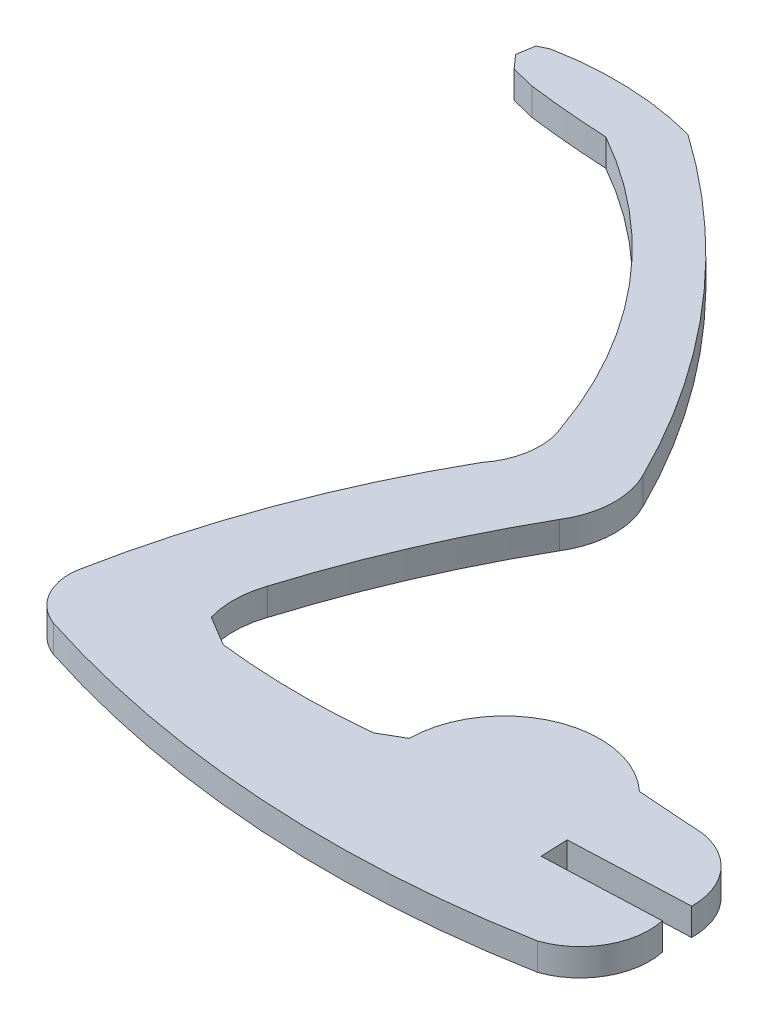
ISO-10303-21;
HEADER;
FILE_DESCRIPTION(('STEP AP214'),'2;1');
FILE_NAME('part.step','',(''),(''),'','','');
FILE_SCHEMA(('AUTOMOTIVE_DESIGN { 1 0 10303 214 1 1 1 1 }'));
ENDSEC;
DATA;
#1=APPLICATION_CONTEXT('core data for automotive mechanical design processes');
#2=APPLICATION_PROTOCOL_DEFINITION('international standard','automotive_design',2000,#1);
#3=PRODUCT_CONTEXT('',#1,'mechanical');
#4=PRODUCT('Part','Part','',(#3));
#5=PRODUCT_RELATED_PRODUCT_CATEGORY('part','',(#4));
#6=PRODUCT_DEFINITION_FORMATION('','',#4);
#7=PRODUCT_DEFINITION_CONTEXT('part definition',#1,'design');
#8=PRODUCT_DEFINITION('design','',#6,#7);
#9=PRODUCT_DEFINITION_SHAPE('','',#8);
#10=(LENGTH_UNIT() NAMED_UNIT(*) SI_UNIT(.MILLI.,.METRE.));
#11=(NAMED_UNIT(*) PLANE_ANGLE_UNIT() SI_UNIT($,.RADIAN.));
#12=(NAMED_UNIT(*) SI_UNIT($,.STERADIAN.) SOLID_ANGLE_UNIT());
#13=UNCERTAINTY_MEASURE_WITH_UNIT(LENGTH_MEASURE(1.E-05),#10,'distance_accuracy_value','');
#14=(GEOMETRIC_REPRESENTATION_CONTEXT(3) GLOBAL_UNCERTAINTY_ASSIGNED_CONTEXT((#13)) GLOBAL_UNIT_ASSIGNED_CONTEXT((#10,
#11,#12)) REPRESENTATION_CONTEXT('',''));
#15=CARTESIAN_POINT('',(0.,0.,0.));
#16=DIRECTION('',(0.,0.,1.));
#17=DIRECTION('',(1.,0.,0.));
#18=AXIS2_PLACEMENT_3D('',#15,#16,#17);
#19=CARTESIAN_POINT('',(-274.22126506996,2.,-439.815808865436));
#20=DIRECTION('',(0.,-1.,0.));
#21=DIRECTION('',(0.,0.,-1.));
#22=AXIS2_PLACEMENT_3D('',#19,#20,#21);
#23=CYLINDRICAL_SURFACE('',#22,3.92701941509999);
#24=CARTESIAN_POINT('',(-274.22126506996,0.,-439.815808865436));
#25=DIRECTION('',(0.,1.,0.));
#26=DIRECTION('',(0.,0.,1.));
#27=AXIS2_PLACEMENT_3D('',#24,#25,#26);
#28=CIRCLE('',#27,3.92701941509999);
#29=CARTESIAN_POINT('',(-278.096570000035,0.,-440.451020000024));
#30=VERTEX_POINT('',#29);
#31=CARTESIAN_POINT('',(-275.639010000101,0.,-436.15363999991));
#32=VERTEX_POINT('',#31);
#33=EDGE_CURVE('E11',#30,#32,#28,.T.);
#34=ORIENTED_EDGE('',*,*,#33,.T.);
#35=DIRECTION('',(0.,-1.,0.));
#36=VECTOR('',#35,1.);
#37=CARTESIAN_POINT('',(-275.639010000101,2.,-436.15363999991));
#38=LINE('',#37,#36);
#39=CARTESIAN_POINT('',(-275.639010000101,2.,-436.15363999991));
#40=VERTEX_POINT('',#39);
#41=EDGE_CURVE('E487',#40,#32,#38,.T.);
#42=ORIENTED_EDGE('',*,*,#41,.F.);
#43=CARTESIAN_POINT('',(-274.22126506996,2.,-439.815808865436));
#44=DIRECTION('',(0.,1.,0.));
#45=DIRECTION('',(0.,0.,1.));
#46=AXIS2_PLACEMENT_3D('',#43,#44,#45);
#47=CIRCLE('',#46,3.92701941509999);
#48=CARTESIAN_POINT('',(-278.096570000035,2.,-440.451020000024));
#49=VERTEX_POINT('',#48);
#50=EDGE_CURVE('E41',#49,#40,#47,.T.);
#51=ORIENTED_EDGE('',*,*,#50,.F.);
#52=DIRECTION('',(0.,-1.,0.));
#53=VECTOR('',#52,1.);
#54=CARTESIAN_POINT('',(-278.096570000035,2.,-440.451020000024));
#55=LINE('',#54,#53);
#56=EDGE_CURVE('E242',#49,#30,#55,.T.);
#57=ORIENTED_EDGE('',*,*,#56,.T.);
#58=EDGE_LOOP('',(#34,#42,#51,#57));
#59=FACE_BOUND('',#58,.T.);
#60=ADVANCED_FACE('F37',(#59),#23,.T.);
#61=CARTESIAN_POINT('',(-251.733783557694,2.,-510.33694022932));
#62=DIRECTION('',(0.,-1.,0.));
#63=DIRECTION('',(0.,0.,-1.));
#64=AXIS2_PLACEMENT_3D('',#61,#62,#63);
#65=CYLINDRICAL_SURFACE('',#64,77.9398606888);
#66=CARTESIAN_POINT('',(-251.733783557694,0.,-510.33694022932));
#67=DIRECTION('',(0.,1.,0.));
#68=DIRECTION('',(0.,0.,1.));
#69=AXIS2_PLACEMENT_3D('',#66,#67,#68);
#70=CIRCLE('',#69,77.9398606888);
#71=CARTESIAN_POINT('',(-237.552510000029,0.,-433.698089999999));
#72=VERTEX_POINT('',#71);
#73=EDGE_CURVE('E47',#32,#72,#70,.T.);
#74=ORIENTED_EDGE('',*,*,#73,.T.);
#75=DIRECTION('',(0.,-1.,0.));
#76=VECTOR('',#75,1.);
#77=CARTESIAN_POINT('',(-237.552510000029,2.,-433.698089999999));
#78=LINE('',#77,#76);
#79=CARTESIAN_POINT('',(-237.552510000029,2.,-433.698089999999));
#80=VERTEX_POINT('',#79);
#81=EDGE_CURVE('E218',#80,#72,#78,.T.);
#82=ORIENTED_EDGE('',*,*,#81,.F.);
#83=CARTESIAN_POINT('',(-251.733783557694,2.,-510.33694022932));
#84=DIRECTION('',(0.,1.,0.));
#85=DIRECTION('',(0.,0.,1.));
#86=AXIS2_PLACEMENT_3D('',#83,#84,#85);
#87=CIRCLE('',#86,77.9398606888);
#88=EDGE_CURVE('E134',#40,#80,#87,.T.);
#89=ORIENTED_EDGE('',*,*,#88,.F.);
#90=ORIENTED_EDGE('',*,*,#41,.T.);
#91=EDGE_LOOP('',(#74,#82,#89,#90));
#92=FACE_BOUND('',#91,.T.);
#93=ADVANCED_FACE('F488',(#92),#65,.T.);
#94=CARTESIAN_POINT('',(-239.234869053948,2.,-438.506591685708));
#95=DIRECTION('',(0.,-1.,0.));
#96=DIRECTION('',(0.,0.,-1.));
#97=AXIS2_PLACEMENT_3D('',#94,#95,#96);
#98=CYLINDRICAL_SURFACE('',#97,5.0943125589001);
#99=CARTESIAN_POINT('',(-239.234869053948,0.,-438.506591685708));
#100=DIRECTION('',(0.,1.,0.));
#101=DIRECTION('',(0.,0.,1.));
#102=AXIS2_PLACEMENT_3D('',#99,#100,#101);
#103=CIRCLE('',#102,5.0943125589001);
#104=CARTESIAN_POINT('',(-234.253990000039,0.,-439.575639999907));
#105=VERTEX_POINT('',#104);
#106=EDGE_CURVE('E212',#72,#105,#103,.T.);
#107=ORIENTED_EDGE('',*,*,#106,.T.);
#108=DIRECTION('',(0.,-1.,0.));
#109=VECTOR('',#108,1.);
#110=CARTESIAN_POINT('',(-234.253990000039,2.,-439.575639999907));
#111=LINE('',#110,#109);
#112=CARTESIAN_POINT('',(-234.253990000039,2.,-439.575639999907));
#113=VERTEX_POINT('',#112);
#114=EDGE_CURVE('E216',#113,#105,#111,.T.);
#115=ORIENTED_EDGE('',*,*,#114,.F.);
#116=CARTESIAN_POINT('',(-239.234869053948,2.,-438.506591685708));
#117=DIRECTION('',(0.,1.,0.));
#118=DIRECTION('',(0.,0.,1.));
#119=AXIS2_PLACEMENT_3D('',#116,#117,#118);
#120=CIRCLE('',#119,5.0943125589001);
#121=EDGE_CURVE('E289',#80,#113,#120,.T.);
#122=ORIENTED_EDGE('',*,*,#121,.F.);
#123=ORIENTED_EDGE('',*,*,#81,.T.);
#124=EDGE_LOOP('',(#107,#115,#122,#123));
#125=FACE_BOUND('',#124,.T.);
#126=ADVANCED_FACE('F214',(#125),#98,.T.);
#127=CARTESIAN_POINT('',(-234.253990000039,2.,-439.575639999907));
#128=DIRECTION('',(0.040186059139724,0.,0.999192214066352));
#129=DIRECTION('',(0.999192214066352,0.,-0.040186059139724));
#130=AXIS2_PLACEMENT_3D('',#127,#128,#129);
#131=PLANE('',#130);
#132=DIRECTION('',(-0.999192214066352,0.,0.040186059139724));
#133=VECTOR('',#132,1.);
#134=CARTESIAN_POINT('',(-234.253990000039,0.,-439.575639999907));
#135=LINE('',#134,#133);
#136=CARTESIAN_POINT('',(-242.830630000012,0.,-439.230699999968));
#137=VERTEX_POINT('',#136);
#138=EDGE_CURVE('E220',#105,#137,#135,.T.);
#139=ORIENTED_EDGE('',*,*,#138,.T.);
#140=DIRECTION('',(0.,-1.,0.));
#141=VECTOR('',#140,1.);
#142=CARTESIAN_POINT('',(-242.830630000012,2.,-439.230699999968));
#143=LINE('',#142,#141);
#144=CARTESIAN_POINT('',(-242.830630000012,2.,-439.230699999968));
#145=VERTEX_POINT('',#144);
#146=EDGE_CURVE('E227',#145,#137,#143,.T.);
#147=ORIENTED_EDGE('',*,*,#146,.F.);
#148=DIRECTION('',(-0.999192214066352,0.,0.040186059139724));
#149=VECTOR('',#148,1.);
#150=CARTESIAN_POINT('',(-234.253990000039,2.,-439.575639999907));
#151=LINE('',#150,#149);
#152=EDGE_CURVE('E226',#113,#145,#151,.T.);
#153=ORIENTED_EDGE('',*,*,#152,.F.);
#154=ORIENTED_EDGE('',*,*,#114,.T.);
#155=EDGE_LOOP('',(#139,#147,#153,#154));
#156=FACE_BOUND('',#155,.T.);
#157=ADVANCED_FACE('F223',(#156),#131,.F.);
#158=CARTESIAN_POINT('',(-242.830630000012,2.,-439.230699999968));
#159=DIRECTION('',(-0.999192261092867,0.,0.040184889848341));
#160=DIRECTION('',(0.040184889848341,0.,0.999192261092867));
#161=AXIS2_PLACEMENT_3D('',#158,#159,#160);
#162=PLANE('',#161);
#163=DIRECTION('',(-0.040184889848341,0.,-0.999192261092867));
#164=VECTOR('',#163,1.);
#165=CARTESIAN_POINT('',(-242.830630000012,0.,-439.230699999968));
#166=LINE('',#165,#164);
#167=CARTESIAN_POINT('',(-242.911000000009,0.,-441.229089999896));
#168=VERTEX_POINT('',#167);
#169=EDGE_CURVE('E232',#137,#168,#166,.T.);
#170=ORIENTED_EDGE('',*,*,#169,.T.);
#171=DIRECTION('',(0.,-1.,0.));
#172=VECTOR('',#171,1.);
#173=CARTESIAN_POINT('',(-242.911000000009,2.,-441.229089999896));
#174=LINE('',#173,#172);
#175=CARTESIAN_POINT('',(-242.911000000009,2.,-441.229089999896));
#176=VERTEX_POINT('',#175);
#177=EDGE_CURVE('E350',#176,#168,#174,.T.);
#178=ORIENTED_EDGE('',*,*,#177,.F.);
#179=DIRECTION('',(-0.040184889848341,0.,-0.999192261092867));
#180=VECTOR('',#179,1.);
#181=CARTESIAN_POINT('',(-242.830630000012,2.,-439.230699999968));
#182=LINE('',#181,#180);
#183=EDGE_CURVE('E286',#145,#176,#182,.T.);
#184=ORIENTED_EDGE('',*,*,#183,.F.);
#185=ORIENTED_EDGE('',*,*,#146,.T.);
#186=EDGE_LOOP('',(#170,#178,#184,#185));
#187=FACE_BOUND('',#186,.T.);
#188=ADVANCED_FACE('F483',(#187),#162,.F.);
#189=CARTESIAN_POINT('',(-242.911000000009,2.,-441.229089999896));
#190=DIRECTION('',(-0.0401857549887955,0.,-0.999192226298814));
#191=DIRECTION('',(-0.999192226298814,0.,0.0401857549887955));
#192=AXIS2_PLACEMENT_3D('',#189,#190,#191);
#193=PLANE('',#192);
#194=DIRECTION('',(0.999192226298814,0.,-0.0401857549887955));
#195=VECTOR('',#194,1.);
#196=CARTESIAN_POINT('',(-242.911000000009,0.,-441.229089999896));
#197=LINE('',#196,#195);
#198=CARTESIAN_POINT('',(-234.109769999948,0.,-441.583059999935));
#199=VERTEX_POINT('',#198);
#200=EDGE_CURVE('E234',#168,#199,#197,.T.);
#201=ORIENTED_EDGE('',*,*,#200,.T.);
#202=DIRECTION('',(0.,-1.,0.));
#203=VECTOR('',#202,1.);
#204=CARTESIAN_POINT('',(-234.109769999948,2.,-441.583059999935));
#205=LINE('',#204,#203);
#206=CARTESIAN_POINT('',(-234.109769999948,2.,-441.583059999935));
#207=VERTEX_POINT('',#206);
#208=EDGE_CURVE('E347',#207,#199,#205,.T.);
#209=ORIENTED_EDGE('',*,*,#208,.F.);
#210=DIRECTION('',(0.999192226298814,0.,-0.0401857549887955));
#211=VECTOR('',#210,1.);
#212=CARTESIAN_POINT('',(-242.911000000009,2.,-441.229089999896));
#213=LINE('',#212,#211);
#214=EDGE_CURVE('E284',#176,#207,#213,.T.);
#215=ORIENTED_EDGE('',*,*,#214,.F.);
#216=ORIENTED_EDGE('',*,*,#177,.T.);
#217=EDGE_LOOP('',(#201,#209,#215,#216));
#218=FACE_BOUND('',#217,.T.);
#219=ADVANCED_FACE('F345',(#218),#193,.F.);
#220=CARTESIAN_POINT('',(-239.110909892009,2.,-441.682689871096));
#221=DIRECTION('',(0.,-1.,0.));
#222=DIRECTION('',(0.,0.,-1.));
#223=AXIS2_PLACEMENT_3D('',#220,#221,#222);
#224=CYLINDRICAL_SURFACE('',#223,5.00213217850003);
#225=CARTESIAN_POINT('',(-239.110909892009,0.,-441.682689871096));
#226=DIRECTION('',(0.,1.,0.));
#227=DIRECTION('',(0.,0.,1.));
#228=AXIS2_PLACEMENT_3D('',#225,#226,#227);
#229=CIRCLE('',#228,5.00213217850003);
#230=CARTESIAN_POINT('',(-238.334759999981,0.,-446.624239999981));
#231=VERTEX_POINT('',#230);
#232=EDGE_CURVE('E339',#199,#231,#229,.T.);
#233=ORIENTED_EDGE('',*,*,#232,.T.);
#234=DIRECTION('',(0.,-1.,0.));
#235=VECTOR('',#234,1.);
#236=CARTESIAN_POINT('',(-238.334759999981,2.,-446.624239999981));
#237=LINE('',#236,#235);
#238=CARTESIAN_POINT('',(-238.334759999981,2.,-446.624239999981));
#239=VERTEX_POINT('',#238);
#240=EDGE_CURVE('E355',#239,#231,#237,.T.);
#241=ORIENTED_EDGE('',*,*,#240,.F.);
#242=CARTESIAN_POINT('',(-239.110909892009,2.,-441.682689871096));
#243=DIRECTION('',(0.,1.,0.));
#244=DIRECTION('',(0.,0.,1.));
#245=AXIS2_PLACEMENT_3D('',#242,#243,#244);
#246=CIRCLE('',#245,5.00213217850003);
#247=EDGE_CURVE('E282',#207,#239,#246,.T.);
#248=ORIENTED_EDGE('',*,*,#247,.F.);
#249=ORIENTED_EDGE('',*,*,#208,.T.);
#250=EDGE_LOOP('',(#233,#241,#248,#249));
#251=FACE_BOUND('',#250,.T.);
#252=ADVANCED_FACE('F353',(#251),#224,.T.);
#253=CARTESIAN_POINT('',(-217.013235186205,2.,-786.303353346965));
#254=DIRECTION('',(0.,-1.,0.));
#255=DIRECTION('',(0.,0.,-1.));
#256=AXIS2_PLACEMENT_3D('',#253,#254,#255);
#257=CYLINDRICAL_SURFACE('',#256,340.347627382031);
#258=CARTESIAN_POINT('',(-217.013235186205,0.,-786.303353346965));
#259=DIRECTION('',(0.,1.,0.));
#260=DIRECTION('',(0.,0.,1.));
#261=AXIS2_PLACEMENT_3D('',#258,#259,#260);
#262=CIRCLE('',#261,340.347627382031);
#263=CARTESIAN_POINT('',(-243.33684000018,0.,-446.975229999997));
#264=VERTEX_POINT('',#263);
#265=EDGE_CURVE('E336',#264,#231,#262,.T.);
#266=ORIENTED_EDGE('',*,*,#265,.F.);
#267=DIRECTION('',(0.,-1.,0.));
#268=VECTOR('',#267,1.);
#269=CARTESIAN_POINT('',(-243.33684000018,2.,-446.975229999997));
#270=LINE('',#269,#268);
#271=CARTESIAN_POINT('',(-243.33684000018,2.,-446.975229999997));
#272=VERTEX_POINT('',#271);
#273=EDGE_CURVE('E362',#272,#264,#270,.T.);
#274=ORIENTED_EDGE('',*,*,#273,.F.);
#275=CARTESIAN_POINT('',(-217.013235186205,2.,-786.303353346965));
#276=DIRECTION('',(0.,1.,0.));
#277=DIRECTION('',(0.,0.,1.));
#278=AXIS2_PLACEMENT_3D('',#275,#276,#277);
#279=CIRCLE('',#278,340.347627382031);
#280=EDGE_CURVE('E279',#272,#239,#279,.T.);
#281=ORIENTED_EDGE('',*,*,#280,.T.);
#282=ORIENTED_EDGE('',*,*,#240,.T.);
#283=EDGE_LOOP('',(#266,#274,#281,#282));
#284=FACE_BOUND('',#283,.T.);
#285=ADVANCED_FACE('F361',(#284),#257,.F.);
#286=CARTESIAN_POINT('',(-248.1458302378,2.,-441.83572989779));
#287=DIRECTION('',(0.,-1.,0.));
#288=DIRECTION('',(0.,0.,-1.));
#289=AXIS2_PLACEMENT_3D('',#286,#287,#288);
#290=CYLINDRICAL_SURFACE('',#289,7.03852601089998);
#291=CARTESIAN_POINT('',(-248.1458302378,0.,-441.83572989779));
#292=DIRECTION('',(0.,1.,0.));
#293=DIRECTION('',(0.,0.,1.));
#294=AXIS2_PLACEMENT_3D('',#291,#292,#293);
#295=CIRCLE('',#294,7.03852601089998);
#296=CARTESIAN_POINT('',(-255.184160000021,0.,-441.888290000021));
#297=VERTEX_POINT('',#296);
#298=EDGE_CURVE('E334',#264,#297,#295,.T.);
#299=ORIENTED_EDGE('',*,*,#298,.T.);
#300=DIRECTION('',(0.,-1.,0.));
#301=VECTOR('',#300,1.);
#302=CARTESIAN_POINT('',(-255.184160000021,2.,-441.888290000021));
#303=LINE('',#302,#301);
#304=CARTESIAN_POINT('',(-255.184160000021,2.,-441.888290000021));
#305=VERTEX_POINT('',#304);
#306=EDGE_CURVE('E366',#305,#297,#303,.T.);
#307=ORIENTED_EDGE('',*,*,#306,.F.);
#308=CARTESIAN_POINT('',(-248.1458302378,2.,-441.83572989779));
#309=DIRECTION('',(0.,1.,0.));
#310=DIRECTION('',(0.,0.,1.));
#311=AXIS2_PLACEMENT_3D('',#308,#309,#310);
#312=CIRCLE('',#311,7.03852601089998);
#313=EDGE_CURVE('E277',#272,#305,#312,.T.);
#314=ORIENTED_EDGE('',*,*,#313,.F.);
#315=ORIENTED_EDGE('',*,*,#273,.T.);
#316=EDGE_LOOP('',(#299,#307,#314,#315));
#317=FACE_BOUND('',#316,.T.);
#318=ADVANCED_FACE('F480',(#317),#290,.T.);
#319=CARTESIAN_POINT('',(-255.184160000021,2.,-441.888290000021));
#320=DIRECTION('',(0.500754897130129,0.,0.865589124816269));
#321=DIRECTION('',(0.865589124816269,0.,-0.500754897130129));
#322=AXIS2_PLACEMENT_3D('',#319,#320,#321);
#323=PLANE('',#322);
#324=DIRECTION('',(-0.865589124816269,0.,0.500754897130129));
#325=VECTOR('',#324,1.);
#326=CARTESIAN_POINT('',(-255.184160000021,0.,-441.888290000021));
#327=LINE('',#326,#325);
#328=CARTESIAN_POINT('',(-256.851709999999,0.,-440.923590000034));
#329=VERTEX_POINT('',#328);
#330=EDGE_CURVE('E331',#297,#329,#327,.T.);
#331=ORIENTED_EDGE('',*,*,#330,.T.);
#332=DIRECTION('',(0.,-1.,0.));
#333=VECTOR('',#332,1.);
#334=CARTESIAN_POINT('',(-256.851709999999,2.,-440.923590000034));
#335=LINE('',#334,#333);
#336=CARTESIAN_POINT('',(-256.851709999999,2.,-440.923590000034));
#337=VERTEX_POINT('',#336);
#338=EDGE_CURVE('E372',#337,#329,#335,.T.);
#339=ORIENTED_EDGE('',*,*,#338,.F.);
#340=DIRECTION('',(-0.865589124816269,0.,0.500754897130129));
#341=VECTOR('',#340,1.);
#342=CARTESIAN_POINT('',(-255.184160000021,2.,-441.888290000021));
#343=LINE('',#342,#341);
#344=EDGE_CURVE('E275',#305,#337,#343,.T.);
#345=ORIENTED_EDGE('',*,*,#344,.F.);
#346=ORIENTED_EDGE('',*,*,#306,.T.);
#347=EDGE_LOOP('',(#331,#339,#345,#346));
#348=FACE_BOUND('',#347,.T.);
#349=ADVANCED_FACE('F476',(#348),#323,.F.);
#350=CARTESIAN_POINT('',(-262.025023213898,2.,-491.59750002542));
#351=DIRECTION('',(0.,-1.,0.));
#352=DIRECTION('',(0.,0.,-1.));
#353=AXIS2_PLACEMENT_3D('',#350,#351,#352);
#354=CYLINDRICAL_SURFACE('',#353,50.9372979934174);
#355=CARTESIAN_POINT('',(-262.025023213898,0.,-491.59750002542));
#356=DIRECTION('',(0.,1.,0.));
#357=DIRECTION('',(0.,0.,1.));
#358=AXIS2_PLACEMENT_3D('',#355,#356,#357);
#359=CIRCLE('',#358,50.9372979934174);
#360=CARTESIAN_POINT('',(-267.997119999992,0.,-441.011510000041));
#361=VERTEX_POINT('',#360);
#362=EDGE_CURVE('E328',#361,#329,#359,.T.);
#363=ORIENTED_EDGE('',*,*,#362,.F.);
#364=DIRECTION('',(0.,-1.,0.));
#365=VECTOR('',#364,1.);
#366=CARTESIAN_POINT('',(-267.997119999992,2.,-441.011510000041));
#367=LINE('',#366,#365);
#368=CARTESIAN_POINT('',(-267.997119999992,2.,-441.011510000041));
#369=VERTEX_POINT('',#368);
#370=EDGE_CURVE('E374',#369,#361,#367,.T.);
#371=ORIENTED_EDGE('',*,*,#370,.F.);
#372=CARTESIAN_POINT('',(-262.025023213898,2.,-491.59750002542));
#373=DIRECTION('',(0.,1.,0.));
#374=DIRECTION('',(0.,0.,1.));
#375=AXIS2_PLACEMENT_3D('',#372,#373,#374);
#376=CIRCLE('',#375,50.9372979934174);
#377=EDGE_CURVE('E272',#369,#337,#376,.T.);
#378=ORIENTED_EDGE('',*,*,#377,.T.);
#379=ORIENTED_EDGE('',*,*,#338,.T.);
#380=EDGE_LOOP('',(#363,#371,#378,#379));
#381=FACE_BOUND('',#380,.T.);
#382=ADVANCED_FACE('F473',(#381),#354,.F.);
#383=CARTESIAN_POINT('',(-267.997119999993,2.,-441.011510000038));
#384=DIRECTION('',(-0.514221496956717,0.,0.857657421158118));
#385=DIRECTION('',(0.857657421158118,0.,0.514221496956717));
#386=AXIS2_PLACEMENT_3D('',#383,#384,#385);
#387=PLANE('',#386);
#388=DIRECTION('',(-0.857657421158118,0.,-0.514221496956717));
#389=VECTOR('',#388,1.);
#390=CARTESIAN_POINT('',(-267.997119999993,0.,-441.011510000038));
#391=LINE('',#390,#389);
#392=CARTESIAN_POINT('',(-270.19096,0.,-442.32686));
#393=VERTEX_POINT('',#392);
#394=EDGE_CURVE('E325',#361,#393,#391,.T.);
#395=ORIENTED_EDGE('',*,*,#394,.T.);
#396=DIRECTION('',(0.,-1.,0.));
#397=VECTOR('',#396,1.);
#398=CARTESIAN_POINT('',(-270.19096,2.,-442.32686));
#399=LINE('',#398,#397);
#400=CARTESIAN_POINT('',(-270.19096,2.,-442.32686));
#401=VERTEX_POINT('',#400);
#402=EDGE_CURVE('E376',#401,#393,#399,.T.);
#403=ORIENTED_EDGE('',*,*,#402,.F.);
#404=DIRECTION('',(-0.857657421158118,0.,-0.514221496956717));
#405=VECTOR('',#404,1.);
#406=CARTESIAN_POINT('',(-267.997119999993,2.,-441.011510000038));
#407=LINE('',#406,#405);
#408=EDGE_CURVE('E270',#369,#401,#407,.T.);
#409=ORIENTED_EDGE('',*,*,#408,.F.);
#410=ORIENTED_EDGE('',*,*,#370,.T.);
#411=EDGE_LOOP('',(#395,#403,#409,#410));
#412=FACE_BOUND('',#411,.T.);
#413=ADVANCED_FACE('F470',(#412),#387,.F.);
#414=CARTESIAN_POINT('',(-263.721229898124,2.,-444.204594696384));
#415=DIRECTION('',(0.,-1.,0.));
#416=DIRECTION('',(0.,0.,-1.));
#417=AXIS2_PLACEMENT_3D('',#414,#415,#416);
#418=CYLINDRICAL_SURFACE('',#417,6.73671249060423);
#419=CARTESIAN_POINT('',(-263.721229898124,0.,-444.204594696384));
#420=DIRECTION('',(0.,1.,0.));
#421=DIRECTION('',(0.,0.,1.));
#422=AXIS2_PLACEMENT_3D('',#419,#420,#421);
#423=CIRCLE('',#422,6.73671249060423);
#424=CARTESIAN_POINT('',(-270.103430000059,0.,-446.361169999945));
#425=VERTEX_POINT('',#424);
#426=EDGE_CURVE('E322',#425,#393,#423,.T.);
#427=ORIENTED_EDGE('',*,*,#426,.F.);
#428=DIRECTION('',(0.,-1.,0.));
#429=VECTOR('',#428,1.);
#430=CARTESIAN_POINT('',(-270.103430000059,2.,-446.361169999945));
#431=LINE('',#430,#429);
#432=CARTESIAN_POINT('',(-270.103430000059,2.,-446.361169999945));
#433=VERTEX_POINT('',#432);
#434=EDGE_CURVE('E378',#433,#425,#431,.T.);
#435=ORIENTED_EDGE('',*,*,#434,.F.);
#436=CARTESIAN_POINT('',(-263.721229898124,2.,-444.204594696384));
#437=DIRECTION('',(0.,1.,0.));
#438=DIRECTION('',(0.,0.,1.));
#439=AXIS2_PLACEMENT_3D('',#436,#437,#438);
#440=CIRCLE('',#439,6.73671249060423);
#441=EDGE_CURVE('E267',#433,#401,#440,.T.);
#442=ORIENTED_EDGE('',*,*,#441,.T.);
#443=ORIENTED_EDGE('',*,*,#402,.T.);
#444=EDGE_LOOP('',(#427,#435,#442,#443));
#445=FACE_BOUND('',#444,.T.);
#446=ADVANCED_FACE('F465',(#445),#418,.F.);
#447=CARTESIAN_POINT('',(-198.8151189418,2.,-424.3956924438));
#448=DIRECTION('',(0.,-1.,0.));
#449=DIRECTION('',(0.,0.,-1.));
#450=AXIS2_PLACEMENT_3D('',#447,#448,#449);
#451=CYLINDRICAL_SURFACE('',#450,74.5956131271);
#452=CARTESIAN_POINT('',(-198.8151189418,0.,-424.3956924438));
#453=DIRECTION('',(0.,1.,0.));
#454=DIRECTION('',(0.,0.,1.));
#455=AXIS2_PLACEMENT_3D('',#452,#453,#454);
#456=CIRCLE('',#455,74.5956131271);
#457=CARTESIAN_POINT('',(-263.609420000075,0.,-461.35788999992));
#458=VERTEX_POINT('',#457);
#459=EDGE_CURVE('E319',#458,#425,#456,.T.);
#460=ORIENTED_EDGE('',*,*,#459,.F.);
#461=DIRECTION('',(0.,-1.,0.));
#462=VECTOR('',#461,1.);
#463=CARTESIAN_POINT('',(-263.609420000075,2.,-461.35788999992));
#464=LINE('',#463,#462);
#465=CARTESIAN_POINT('',(-263.609420000075,2.,-461.35788999992));
#466=VERTEX_POINT('',#465);
#467=EDGE_CURVE('E380',#466,#458,#464,.T.);
#468=ORIENTED_EDGE('',*,*,#467,.F.);
#469=CARTESIAN_POINT('',(-198.8151189418,2.,-424.3956924438));
#470=DIRECTION('',(0.,1.,0.));
#471=DIRECTION('',(0.,0.,1.));
#472=AXIS2_PLACEMENT_3D('',#469,#470,#471);
#473=CIRCLE('',#472,74.5956131271);
#474=EDGE_CURVE('E264',#466,#433,#473,.T.);
#475=ORIENTED_EDGE('',*,*,#474,.T.);
#476=ORIENTED_EDGE('',*,*,#434,.T.);
#477=EDGE_LOOP('',(#460,#468,#475,#476));
#478=FACE_BOUND('',#477,.T.);
#479=ADVANCED_FACE('F460',(#478),#451,.F.);
#480=CARTESIAN_POINT('',(-268.700979891225,2.,-464.53037242465));
#481=DIRECTION('',(0.,-1.,0.));
#482=DIRECTION('',(0.,0.,-1.));
#483=AXIS2_PLACEMENT_3D('',#480,#481,#482);
#484=CYLINDRICAL_SURFACE('',#483,5.99905216349998);
#485=CARTESIAN_POINT('',(-268.700979891225,0.,-464.53037242465));
#486=DIRECTION('',(0.,1.,0.));
#487=DIRECTION('',(0.,0.,1.));
#488=AXIS2_PLACEMENT_3D('',#485,#486,#487);
#489=CIRCLE('',#488,5.99905216349998);
#490=CARTESIAN_POINT('',(-263.345719999998,0.,-467.234039999965));
#491=VERTEX_POINT('',#490);
#492=EDGE_CURVE('E317',#458,#491,#489,.T.);
#493=ORIENTED_EDGE('',*,*,#492,.T.);
#494=DIRECTION('',(0.,-1.,0.));
#495=VECTOR('',#494,1.);
#496=CARTESIAN_POINT('',(-263.345719999998,2.,-467.234039999965));
#497=LINE('',#496,#495);
#498=CARTESIAN_POINT('',(-263.345719999998,2.,-467.234039999965));
#499=VERTEX_POINT('',#498);
#500=EDGE_CURVE('E382',#499,#491,#497,.T.);
#501=ORIENTED_EDGE('',*,*,#500,.F.);
#502=CARTESIAN_POINT('',(-268.700979891225,2.,-464.53037242465));
#503=DIRECTION('',(0.,1.,0.));
#504=DIRECTION('',(0.,0.,1.));
#505=AXIS2_PLACEMENT_3D('',#502,#503,#504);
#506=CIRCLE('',#505,5.99905216349998);
#507=EDGE_CURVE('E262',#466,#499,#506,.T.);
#508=ORIENTED_EDGE('',*,*,#507,.F.);
#509=ORIENTED_EDGE('',*,*,#467,.T.);
#510=EDGE_LOOP('',(#493,#501,#508,#509));
#511=FACE_BOUND('',#510,.T.);
#512=ADVANCED_FACE('F457',(#511),#484,.T.);
#513=CARTESIAN_POINT('',(-319.331889344475,2.,-439.483729236183));
#514=DIRECTION('',(0.,-1.,0.));
#515=DIRECTION('',(0.,0.,-1.));
#516=AXIS2_PLACEMENT_3D('',#513,#514,#515);
#517=CYLINDRICAL_SURFACE('',#516,62.4862457294);
#518=CARTESIAN_POINT('',(-319.331889344475,0.,-439.483729236183));
#519=DIRECTION('',(0.,1.,0.));
#520=DIRECTION('',(0.,0.,1.));
#521=AXIS2_PLACEMENT_3D('',#518,#519,#520);
#522=CIRCLE('',#521,62.4862457294);
#523=CARTESIAN_POINT('',(-283.40723000004,0.,-490.610529999982));
#524=VERTEX_POINT('',#523);
#525=EDGE_CURVE('E315',#491,#524,#522,.T.);
#526=ORIENTED_EDGE('',*,*,#525,.T.);
#527=DIRECTION('',(0.,-1.,0.));
#528=VECTOR('',#527,1.);
#529=CARTESIAN_POINT('',(-283.40723000004,2.,-490.610529999982));
#530=LINE('',#529,#528);
#531=CARTESIAN_POINT('',(-283.40723000004,2.,-490.610529999982));
#532=VERTEX_POINT('',#531);
#533=EDGE_CURVE('E385',#532,#524,#530,.T.);
#534=ORIENTED_EDGE('',*,*,#533,.F.);
#535=CARTESIAN_POINT('',(-319.331889344475,2.,-439.483729236183));
#536=DIRECTION('',(0.,1.,0.));
#537=DIRECTION('',(0.,0.,1.));
#538=AXIS2_PLACEMENT_3D('',#535,#536,#537);
#539=CIRCLE('',#538,62.4862457294);
#540=EDGE_CURVE('E260',#499,#532,#539,.T.);
#541=ORIENTED_EDGE('',*,*,#540,.F.);
#542=ORIENTED_EDGE('',*,*,#500,.T.);
#543=EDGE_LOOP('',(#526,#534,#541,#542));
#544=FACE_BOUND('',#543,.T.);
#545=ADVANCED_FACE('F452',(#544),#517,.T.);
#546=CARTESIAN_POINT('',(-289.504970687434,2.,-468.093339655013));
#547=DIRECTION('',(0.,-1.,0.));
#548=DIRECTION('',(0.,0.,-1.));
#549=AXIS2_PLACEMENT_3D('',#546,#547,#548);
#550=CYLINDRICAL_SURFACE('',#549,23.328229734);
#551=CARTESIAN_POINT('',(-289.504970687434,0.,-468.093339655013));
#552=DIRECTION('',(0.,1.,0.));
#553=DIRECTION('',(0.,0.,1.));
#554=AXIS2_PLACEMENT_3D('',#551,#552,#553);
#555=CIRCLE('',#554,23.328229734);
#556=CARTESIAN_POINT('',(-293.919960000018,0.,-490.999979999945));
#557=VERTEX_POINT('',#556);
#558=EDGE_CURVE('E313',#524,#557,#555,.T.);
#559=ORIENTED_EDGE('',*,*,#558,.T.);
#560=DIRECTION('',(0.,-1.,0.));
#561=VECTOR('',#560,1.);
#562=CARTESIAN_POINT('',(-293.919960000018,2.,-490.999979999945));
#563=LINE('',#562,#561);
#564=CARTESIAN_POINT('',(-293.919960000018,2.,-490.999979999945));
#565=VERTEX_POINT('',#564);
#566=EDGE_CURVE('E388',#565,#557,#563,.T.);
#567=ORIENTED_EDGE('',*,*,#566,.F.);
#568=CARTESIAN_POINT('',(-289.504970687434,2.,-468.093339655013));
#569=DIRECTION('',(0.,1.,0.));
#570=DIRECTION('',(0.,0.,1.));
#571=AXIS2_PLACEMENT_3D('',#568,#569,#570);
#572=CIRCLE('',#571,23.328229734);
#573=EDGE_CURVE('E258',#532,#565,#572,.T.);
#574=ORIENTED_EDGE('',*,*,#573,.F.);
#575=ORIENTED_EDGE('',*,*,#533,.T.);
#576=EDGE_LOOP('',(#559,#567,#574,#575));
#577=FACE_BOUND('',#576,.T.);
#578=ADVANCED_FACE('F446',(#577),#550,.T.);
#579=CARTESIAN_POINT('',(-293.919960000018,2.,-490.999979999945));
#580=DIRECTION('',(0.433793166470083,0.,0.901012479782527));
#581=DIRECTION('',(0.901012479782527,0.,-0.433793166470083));
#582=AXIS2_PLACEMENT_3D('',#579,#580,#581);
#583=PLANE('',#582);
#584=DIRECTION('',(-0.901012479782527,0.,0.433793166470083));
#585=VECTOR('',#584,1.);
#586=CARTESIAN_POINT('',(-293.919960000018,0.,-490.999979999945));
#587=LINE('',#586,#585);
#588=CARTESIAN_POINT('',(-294.63185,0.,-490.65724));
#589=VERTEX_POINT('',#588);
#590=EDGE_CURVE('E311',#557,#589,#587,.T.);
#591=ORIENTED_EDGE('',*,*,#590,.T.);
#592=DIRECTION('',(0.,-1.,0.));
#593=VECTOR('',#592,1.);
#594=CARTESIAN_POINT('',(-294.63185,2.,-490.65724));
#595=LINE('',#594,#593);
#596=CARTESIAN_POINT('',(-294.63185,2.,-490.65724));
#597=VERTEX_POINT('',#596);
#598=EDGE_CURVE('E391',#597,#589,#595,.T.);
#599=ORIENTED_EDGE('',*,*,#598,.F.);
#600=DIRECTION('',(-0.901012479782527,0.,0.433793166470083));
#601=VECTOR('',#600,1.);
#602=CARTESIAN_POINT('',(-293.919960000018,2.,-490.999979999945));
#603=LINE('',#602,#601);
#604=EDGE_CURVE('E256',#565,#597,#603,.T.);
#605=ORIENTED_EDGE('',*,*,#604,.F.);
#606=ORIENTED_EDGE('',*,*,#566,.T.);
#607=EDGE_LOOP('',(#591,#599,#605,#606));
#608=FACE_BOUND('',#607,.T.);
#609=ADVANCED_FACE('F442',(#608),#583,.F.);
#610=CARTESIAN_POINT('',(-294.63185,2.,-490.65724));
#611=DIRECTION('',(0.986902006869556,0.,0.161320887788414));
#612=DIRECTION('',(0.161320887788414,0.,-0.986902006869556));
#613=AXIS2_PLACEMENT_3D('',#610,#611,#612);
#614=PLANE('',#613);
#615=DIRECTION('',(-0.161320887788414,0.,0.986902006869556));
#616=VECTOR('',#615,1.);
#617=CARTESIAN_POINT('',(-294.63185,0.,-490.65724));
#618=LINE('',#617,#616);
#619=CARTESIAN_POINT('',(-294.84293,0.,-489.36593));
#620=VERTEX_POINT('',#619);
#621=EDGE_CURVE('E309',#589,#620,#618,.T.);
#622=ORIENTED_EDGE('',*,*,#621,.T.);
#623=DIRECTION('',(0.,-1.,0.));
#624=VECTOR('',#623,1.);
#625=CARTESIAN_POINT('',(-294.84293,2.,-489.36593));
#626=LINE('',#625,#624);
#627=CARTESIAN_POINT('',(-294.84293,2.,-489.36593));
#628=VERTEX_POINT('',#627);
#629=EDGE_CURVE('E394',#628,#620,#626,.T.);
#630=ORIENTED_EDGE('',*,*,#629,.F.);
#631=DIRECTION('',(-0.161320887788414,0.,0.986902006869556));
#632=VECTOR('',#631,1.);
#633=CARTESIAN_POINT('',(-294.63185,2.,-490.65724));
#634=LINE('',#633,#632);
#635=EDGE_CURVE('E254',#597,#628,#634,.T.);
#636=ORIENTED_EDGE('',*,*,#635,.F.);
#637=ORIENTED_EDGE('',*,*,#598,.T.);
#638=EDGE_LOOP('',(#622,#630,#636,#637));
#639=FACE_BOUND('',#638,.T.);
#640=ADVANCED_FACE('F437',(#639),#614,.F.);
#641=CARTESIAN_POINT('',(-294.84293,2.,-489.36593));
#642=DIRECTION('',(0.746130777443007,0.,-0.665799416455358));
#643=DIRECTION('',(-0.665799416455358,0.,-0.746130777443007));
#644=AXIS2_PLACEMENT_3D('',#641,#642,#643);
#645=PLANE('',#644);
#646=DIRECTION('',(0.665799416455357,0.,0.746130777443006));
#647=VECTOR('',#646,1.);
#648=CARTESIAN_POINT('',(-294.84293,0.,-489.36593));
#649=LINE('',#648,#647);
#650=CARTESIAN_POINT('',(-293.97259,0.,-488.39058));
#651=VERTEX_POINT('',#650);
#652=EDGE_CURVE('E307',#620,#651,#649,.T.);
#653=ORIENTED_EDGE('',*,*,#652,.T.);
#654=DIRECTION('',(0.,-1.,0.));
#655=VECTOR('',#654,1.);
#656=CARTESIAN_POINT('',(-293.97259,2.,-488.39058));
#657=LINE('',#656,#655);
#658=CARTESIAN_POINT('',(-293.97259,2.,-488.39058));
#659=VERTEX_POINT('',#658);
#660=EDGE_CURVE('E397',#659,#651,#657,.T.);
#661=ORIENTED_EDGE('',*,*,#660,.F.);
#662=DIRECTION('',(0.665799416455357,0.,0.746130777443006));
#663=VECTOR('',#662,1.);
#664=CARTESIAN_POINT('',(-294.84293,2.,-489.36593));
#665=LINE('',#664,#663);
#666=EDGE_CURVE('E252',#628,#659,#665,.T.);
#667=ORIENTED_EDGE('',*,*,#666,.F.);
#668=ORIENTED_EDGE('',*,*,#629,.T.);
#669=EDGE_LOOP('',(#653,#661,#667,#668));
#670=FACE_BOUND('',#669,.T.);
#671=ADVANCED_FACE('F431',(#670),#645,.F.);
#672=CARTESIAN_POINT('',(-293.97259,2.,-488.39058));
#673=DIRECTION('',(0.242410799385846,0.,-0.97017369802583));
#674=DIRECTION('',(-0.970173698025831,0.,-0.242410799385846));
#675=AXIS2_PLACEMENT_3D('',#672,#673,#674);
#676=PLANE('',#675);
#677=DIRECTION('',(0.97017369802583,0.,0.242410799385846));
#678=VECTOR('',#677,1.);
#679=CARTESIAN_POINT('',(-293.97259,0.,-488.39058));
#680=LINE('',#679,#678);
#681=CARTESIAN_POINT('',(-292.23524,0.,-487.95648));
#682=VERTEX_POINT('',#681);
#683=EDGE_CURVE('E305',#651,#682,#680,.T.);
#684=ORIENTED_EDGE('',*,*,#683,.T.);
#685=DIRECTION('',(0.,-1.,0.));
#686=VECTOR('',#685,1.);
#687=CARTESIAN_POINT('',(-292.23524,2.,-487.95648));
#688=LINE('',#687,#686);
#689=CARTESIAN_POINT('',(-292.23524,2.,-487.95648));
#690=VERTEX_POINT('',#689);
#691=EDGE_CURVE('E400',#690,#682,#688,.T.);
#692=ORIENTED_EDGE('',*,*,#691,.F.);
#693=DIRECTION('',(0.97017369802583,0.,0.242410799385846));
#694=VECTOR('',#693,1.);
#695=CARTESIAN_POINT('',(-293.97259,2.,-488.39058));
#696=LINE('',#695,#694);
#697=EDGE_CURVE('E250',#659,#690,#696,.T.);
#698=ORIENTED_EDGE('',*,*,#697,.F.);
#699=ORIENTED_EDGE('',*,*,#660,.T.);
#700=EDGE_LOOP('',(#684,#692,#698,#699));
#701=FACE_BOUND('',#700,.T.);
#702=ADVANCED_FACE('F427',(#701),#676,.F.);
#703=CARTESIAN_POINT('',(-282.407930636973,2.,-565.314789174484));
#704=DIRECTION('',(0.,-1.,0.));
#705=DIRECTION('',(0.,0.,-1.));
#706=AXIS2_PLACEMENT_3D('',#703,#704,#705);
#707=CYLINDRICAL_SURFACE('',#706,77.9800231319);
#708=CARTESIAN_POINT('',(-282.407930636973,0.,-565.314789174484));
#709=DIRECTION('',(0.,1.,0.));
#710=DIRECTION('',(0.,0.,1.));
#711=AXIS2_PLACEMENT_3D('',#708,#709,#710);
#712=CIRCLE('',#711,77.9800231319);
#713=CARTESIAN_POINT('',(-286.267540000011,0.,-487.430339999977));
#714=VERTEX_POINT('',#713);
#715=EDGE_CURVE('E302',#682,#714,#712,.T.);
#716=ORIENTED_EDGE('',*,*,#715,.T.);
#717=DIRECTION('',(0.,-1.,0.));
#718=VECTOR('',#717,1.);
#719=CARTESIAN_POINT('',(-286.267540000011,2.,-487.430339999977));
#720=LINE('',#719,#718);
#721=CARTESIAN_POINT('',(-286.267540000011,2.,-487.430339999977));
#722=VERTEX_POINT('',#721);
#723=EDGE_CURVE('E403',#722,#714,#720,.T.);
#724=ORIENTED_EDGE('',*,*,#723,.F.);
#725=CARTESIAN_POINT('',(-282.407930636973,2.,-565.314789174484));
#726=DIRECTION('',(0.,1.,0.));
#727=DIRECTION('',(0.,0.,1.));
#728=AXIS2_PLACEMENT_3D('',#725,#726,#727);
#729=CIRCLE('',#728,77.9800231319);
#730=EDGE_CURVE('E248',#690,#722,#729,.T.);
#731=ORIENTED_EDGE('',*,*,#730,.F.);
#732=ORIENTED_EDGE('',*,*,#691,.T.);
#733=EDGE_LOOP('',(#716,#724,#731,#732));
#734=FACE_BOUND('',#733,.T.);
#735=ADVANCED_FACE('F422',(#734),#707,.T.);
#736=CARTESIAN_POINT('',(-304.525956797334,2.,-455.002408102087));
#737=DIRECTION('',(0.,-1.,0.));
#738=DIRECTION('',(0.,0.,-1.));
#739=AXIS2_PLACEMENT_3D('',#736,#737,#738);
#740=CYLINDRICAL_SURFACE('',#739,37.2147894138726);
#741=CARTESIAN_POINT('',(-304.525956797334,0.,-455.002408102087));
#742=DIRECTION('',(0.,1.,0.));
#743=DIRECTION('',(0.,0.,1.));
#744=AXIS2_PLACEMENT_3D('',#741,#742,#743);
#745=CIRCLE('',#744,37.2147894138726);
#746=CARTESIAN_POINT('',(-269.418130000035,0.,-467.346680000007));
#747=VERTEX_POINT('',#746);
#748=EDGE_CURVE('E295',#747,#714,#745,.T.);
#749=ORIENTED_EDGE('',*,*,#748,.F.);
#750=DIRECTION('',(0.,-1.,0.));
#751=VECTOR('',#750,1.);
#752=CARTESIAN_POINT('',(-269.418130000035,2.,-467.346680000007));
#753=LINE('',#752,#751);
#754=CARTESIAN_POINT('',(-269.418130000035,2.,-467.346680000007));
#755=VERTEX_POINT('',#754);
#756=EDGE_CURVE('E405',#755,#747,#753,.T.);
#757=ORIENTED_EDGE('',*,*,#756,.F.);
#758=CARTESIAN_POINT('',(-304.525956797334,2.,-455.002408102087));
#759=DIRECTION('',(0.,1.,0.));
#760=DIRECTION('',(0.,0.,1.));
#761=AXIS2_PLACEMENT_3D('',#758,#759,#760);
#762=CIRCLE('',#761,37.2147894138726);
#763=EDGE_CURVE('E245',#755,#722,#762,.T.);
#764=ORIENTED_EDGE('',*,*,#763,.T.);
#765=ORIENTED_EDGE('',*,*,#723,.T.);
#766=EDGE_LOOP('',(#749,#757,#764,#765));
#767=FACE_BOUND('',#766,.T.);
#768=ADVANCED_FACE('F416',(#767),#740,.F.);
#769=CARTESIAN_POINT('',(-274.094100104639,2.,-465.302579209567));
#770=DIRECTION('',(0.,-1.,0.));
#771=DIRECTION('',(0.,0.,-1.));
#772=AXIS2_PLACEMENT_3D('',#769,#770,#771);
#773=CYLINDRICAL_SURFACE('',#772,5.10323862470001);
#774=CARTESIAN_POINT('',(-274.094100104639,0.,-465.302579209567));
#775=DIRECTION('',(0.,1.,0.));
#776=DIRECTION('',(0.,0.,1.));
#777=AXIS2_PLACEMENT_3D('',#774,#775,#776);
#778=CIRCLE('',#777,5.10323862470001);
#779=CARTESIAN_POINT('',(-270.110630000037,0.,-462.112749999975));
#780=VERTEX_POINT('',#779);
#781=EDGE_CURVE('E292',#780,#747,#778,.T.);
#782=ORIENTED_EDGE('',*,*,#781,.F.);
#783=DIRECTION('',(0.,-1.,0.));
#784=VECTOR('',#783,1.);
#785=CARTESIAN_POINT('',(-270.110630000037,2.,-462.112749999975));
#786=LINE('',#785,#784);
#787=CARTESIAN_POINT('',(-270.110630000037,2.,-462.112749999975));
#788=VERTEX_POINT('',#787);
#789=EDGE_CURVE('E406',#788,#780,#786,.T.);
#790=ORIENTED_EDGE('',*,*,#789,.F.);
#791=CARTESIAN_POINT('',(-274.094100104639,2.,-465.302579209567));
#792=DIRECTION('',(0.,1.,0.));
#793=DIRECTION('',(0.,0.,1.));
#794=AXIS2_PLACEMENT_3D('',#791,#792,#793);
#795=CIRCLE('',#794,5.10323862470001);
#796=EDGE_CURVE('E241',#788,#755,#795,.T.);
#797=ORIENTED_EDGE('',*,*,#796,.T.);
#798=ORIENTED_EDGE('',*,*,#756,.T.);
#799=EDGE_LOOP('',(#782,#790,#797,#798));
#800=FACE_BOUND('',#799,.T.);
#801=ADVANCED_FACE('F411',(#800),#773,.F.);
#802=CARTESIAN_POINT('',(-208.393677102847,2.,-427.056880733827));
#803=DIRECTION('',(0.,-1.,0.));
#804=DIRECTION('',(0.,0.,-1.));
#805=AXIS2_PLACEMENT_3D('',#802,#803,#804);
#806=CYLINDRICAL_SURFACE('',#805,70.9781392044);
#807=CARTESIAN_POINT('',(-208.393677102847,0.,-427.056880733827));
#808=DIRECTION('',(0.,1.,0.));
#809=DIRECTION('',(0.,0.,1.));
#810=AXIS2_PLACEMENT_3D('',#807,#808,#809);
#811=CIRCLE('',#810,70.9781392044);
#812=EDGE_CURVE('E145',#780,#30,#811,.T.);
#813=ORIENTED_EDGE('',*,*,#812,.T.);
#814=ORIENTED_EDGE('',*,*,#56,.F.);
#815=CARTESIAN_POINT('',(-208.393677102847,2.,-427.056880733827));
#816=DIRECTION('',(0.,1.,0.));
#817=DIRECTION('',(0.,0.,1.));
#818=AXIS2_PLACEMENT_3D('',#815,#816,#817);
#819=CIRCLE('',#818,70.9781392044);
#820=EDGE_CURVE('E239',#788,#49,#819,.T.);
#821=ORIENTED_EDGE('',*,*,#820,.F.);
#822=ORIENTED_EDGE('',*,*,#789,.T.);
#823=EDGE_LOOP('',(#813,#814,#821,#822));
#824=FACE_BOUND('',#823,.T.);
#825=ADVANCED_FACE('F540',(#824),#806,.T.);
#826=CARTESIAN_POINT('',(-274.22126506996,2.,-439.815808865436));
#827=DIRECTION('',(0.,1.,0.));
#828=DIRECTION('',(0.,0.,1.));
#829=AXIS2_PLACEMENT_3D('',#826,#827,#828);
#830=PLANE('',#829);
#831=ORIENTED_EDGE('',*,*,#50,.T.);
#832=ORIENTED_EDGE('',*,*,#88,.T.);
#833=ORIENTED_EDGE('',*,*,#121,.T.);
#834=ORIENTED_EDGE('',*,*,#152,.T.);
#835=ORIENTED_EDGE('',*,*,#183,.T.);
#836=ORIENTED_EDGE('',*,*,#214,.T.);
#837=ORIENTED_EDGE('',*,*,#247,.T.);
#838=ORIENTED_EDGE('',*,*,#280,.F.);
#839=ORIENTED_EDGE('',*,*,#313,.T.);
#840=ORIENTED_EDGE('',*,*,#344,.T.);
#841=ORIENTED_EDGE('',*,*,#377,.F.);
#842=ORIENTED_EDGE('',*,*,#408,.T.);
#843=ORIENTED_EDGE('',*,*,#441,.F.);
#844=ORIENTED_EDGE('',*,*,#474,.F.);
#845=ORIENTED_EDGE('',*,*,#507,.T.);
#846=ORIENTED_EDGE('',*,*,#540,.T.);
#847=ORIENTED_EDGE('',*,*,#573,.T.);
#848=ORIENTED_EDGE('',*,*,#604,.T.);
#849=ORIENTED_EDGE('',*,*,#635,.T.);
#850=ORIENTED_EDGE('',*,*,#666,.T.);
#851=ORIENTED_EDGE('',*,*,#697,.T.);
#852=ORIENTED_EDGE('',*,*,#730,.T.);
#853=ORIENTED_EDGE('',*,*,#763,.F.);
#854=ORIENTED_EDGE('',*,*,#796,.F.);
#855=ORIENTED_EDGE('',*,*,#820,.T.);
#856=EDGE_LOOP('',(#831,#832,#833,#834,#835,#836,#837,#838,#839,#840,#841,#842,#843,#844,#845,
#846,#847,#848,#849,#850,#851,#852,#853,#854,#855));
#857=FACE_BOUND('',#856,.T.);
#858=ADVANCED_FACE('F39',(#857),#830,.T.);
#859=CARTESIAN_POINT('',(-274.22126506996,0.,-439.815808865436));
#860=DIRECTION('',(0.,1.,0.));
#861=DIRECTION('',(0.,0.,1.));
#862=AXIS2_PLACEMENT_3D('',#859,#860,#861);
#863=PLANE('',#862);
#864=ORIENTED_EDGE('',*,*,#33,.F.);
#865=ORIENTED_EDGE('',*,*,#812,.F.);
#866=ORIENTED_EDGE('',*,*,#781,.T.);
#867=ORIENTED_EDGE('',*,*,#748,.T.);
#868=ORIENTED_EDGE('',*,*,#715,.F.);
#869=ORIENTED_EDGE('',*,*,#683,.F.);
#870=ORIENTED_EDGE('',*,*,#652,.F.);
#871=ORIENTED_EDGE('',*,*,#621,.F.);
#872=ORIENTED_EDGE('',*,*,#590,.F.);
#873=ORIENTED_EDGE('',*,*,#558,.F.);
#874=ORIENTED_EDGE('',*,*,#525,.F.);
#875=ORIENTED_EDGE('',*,*,#492,.F.);
#876=ORIENTED_EDGE('',*,*,#459,.T.);
#877=ORIENTED_EDGE('',*,*,#426,.T.);
#878=ORIENTED_EDGE('',*,*,#394,.F.);
#879=ORIENTED_EDGE('',*,*,#362,.T.);
#880=ORIENTED_EDGE('',*,*,#330,.F.);
#881=ORIENTED_EDGE('',*,*,#298,.F.);
#882=ORIENTED_EDGE('',*,*,#265,.T.);
#883=ORIENTED_EDGE('',*,*,#232,.F.);
#884=ORIENTED_EDGE('',*,*,#200,.F.);
#885=ORIENTED_EDGE('',*,*,#169,.F.);
#886=ORIENTED_EDGE('',*,*,#138,.F.);
#887=ORIENTED_EDGE('',*,*,#106,.F.);
#888=ORIENTED_EDGE('',*,*,#73,.F.);
#889=EDGE_LOOP('',(#864,#865,#866,#867,#868,#869,#870,#871,#872,#873,#874,#875,#876,#877,#878,
#879,#880,#881,#882,#883,#884,#885,#886,#887,#888));
#890=FACE_BOUND('',#889,.T.);
#891=ADVANCED_FACE('F230',(#890),#863,.F.);
#892=CLOSED_SHELL('',(#60,#93,#126,#157,#188,#219,#252,#285,#318,#349,#382,#413,#446,#479,#512,
#545,#578,#609,#640,#671,#702,#735,#768,#801,#825,#858,#891));
#893=MANIFOLD_SOLID_BREP('B2',#892);
#894=ADVANCED_BREP_SHAPE_REPRESENTATION('',(#18,#893),#14);
#895=SHAPE_DEFINITION_REPRESENTATION(#9,#894);
ENDSEC;
END-ISO-10303-21;
